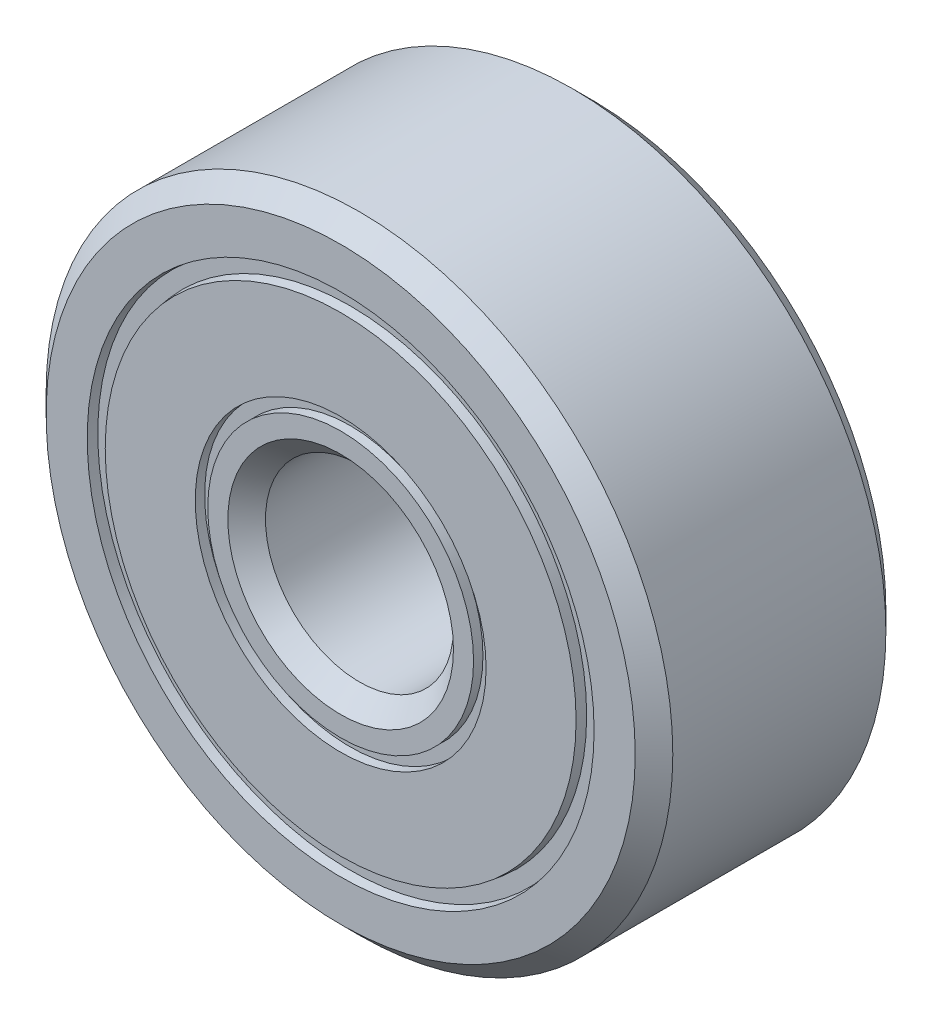
ISO-10303-21;
HEADER;
FILE_DESCRIPTION(('STEP AP214'),'2;1');
FILE_NAME('part.step','',(''),(''),'','','');
FILE_SCHEMA(('AUTOMOTIVE_DESIGN { 1 0 10303 214 1 1 1 1 }'));
ENDSEC;
DATA;
#1=APPLICATION_CONTEXT('core data for automotive mechanical design processes');
#2=APPLICATION_PROTOCOL_DEFINITION('international standard','automotive_design',2000,#1);
#3=PRODUCT_CONTEXT('',#1,'mechanical');
#4=PRODUCT('Part','Part','',(#3));
#5=PRODUCT_RELATED_PRODUCT_CATEGORY('part','',(#4));
#6=PRODUCT_DEFINITION_FORMATION('','',#4);
#7=PRODUCT_DEFINITION_CONTEXT('part definition',#1,'design');
#8=PRODUCT_DEFINITION('design','',#6,#7);
#9=PRODUCT_DEFINITION_SHAPE('','',#8);
#10=(LENGTH_UNIT() NAMED_UNIT(*) SI_UNIT(.MILLI.,.METRE.));
#11=(NAMED_UNIT(*) PLANE_ANGLE_UNIT() SI_UNIT($,.RADIAN.));
#12=(NAMED_UNIT(*) SI_UNIT($,.STERADIAN.) SOLID_ANGLE_UNIT());
#13=UNCERTAINTY_MEASURE_WITH_UNIT(LENGTH_MEASURE(1.E-05),#10,'distance_accuracy_value','');
#14=(GEOMETRIC_REPRESENTATION_CONTEXT(3) GLOBAL_UNCERTAINTY_ASSIGNED_CONTEXT((#13)) GLOBAL_UNIT_ASSIGNED_CONTEXT((#10,
#11,#12)) REPRESENTATION_CONTEXT('',''));
#15=CARTESIAN_POINT('',(0.,0.,0.));
#16=DIRECTION('',(0.,0.,1.));
#17=DIRECTION('',(1.,0.,0.));
#18=AXIS2_PLACEMENT_3D('',#15,#16,#17);
#19=CARTESIAN_POINT('',(0.,0.,4.));
#20=DIRECTION('',(0.,0.,1.));
#21=DIRECTION('',(1.,0.,0.));
#22=AXIS2_PLACEMENT_3D('',#19,#20,#21);
#23=PLANE('',#22);
#24=CARTESIAN_POINT('',(0.,0.,4.));
#25=DIRECTION('',(0.,0.,1.));
#26=DIRECTION('',(1.,0.,0.));
#27=AXIS2_PLACEMENT_3D('',#24,#25,#26);
#28=CIRCLE('',#27,1.8);
#29=CARTESIAN_POINT('',(1.8,0.,4.));
#30=VERTEX_POINT('',#29);
#31=EDGE_CURVE('E49',#30,#30,#28,.F.);
#32=ORIENTED_EDGE('',*,*,#31,.T.);
#33=EDGE_LOOP('',(#32));
#34=FACE_BOUND('',#33,.T.);
#35=CARTESIAN_POINT('',(0.,0.,4.));
#36=DIRECTION('',(0.,0.,1.));
#37=DIRECTION('',(1.,0.,0.));
#38=AXIS2_PLACEMENT_3D('',#35,#36,#37);
#39=CIRCLE('',#38,2.12073359611509);
#40=CARTESIAN_POINT('',(2.12073359611509,0.,4.));
#41=VERTEX_POINT('',#40);
#42=EDGE_CURVE('E40',#41,#41,#39,.T.);
#43=ORIENTED_EDGE('',*,*,#42,.T.);
#44=EDGE_LOOP('',(#43));
#45=FACE_BOUND('',#44,.T.);
#46=ADVANCED_FACE('F36',(#34,#45),#23,.T.);
#47=CARTESIAN_POINT('',(0.,0.,4.));
#48=DIRECTION('',(0.,0.,1.));
#49=DIRECTION('',(1.,0.,0.));
#50=AXIS2_PLACEMENT_3D('',#47,#48,#49);
#51=CIRCLE('',#50,3.75671669190625);
#52=CARTESIAN_POINT('',(3.75671669190625,0.,4.));
#53=VERTEX_POINT('',#52);
#54=EDGE_CURVE('E53',#53,#53,#51,.T.);
#55=ORIENTED_EDGE('',*,*,#54,.T.);
#56=EDGE_LOOP('',(#55));
#57=FACE_BOUND('',#56,.T.);
#58=CARTESIAN_POINT('',(0.,0.,4.));
#59=DIRECTION('',(0.,0.,1.));
#60=DIRECTION('',(1.,0.,0.));
#61=AXIS2_PLACEMENT_3D('',#58,#59,#60);
#62=CIRCLE('',#61,2.32073359611509);
#63=CARTESIAN_POINT('',(2.32073359611509,0.,4.));
#64=VERTEX_POINT('',#63);
#65=EDGE_CURVE('E76',#64,#64,#62,.F.);
#66=ORIENTED_EDGE('',*,*,#65,.T.);
#67=EDGE_LOOP('',(#66));
#68=FACE_BOUND('',#67,.T.);
#69=ADVANCED_FACE('F145',(#57,#68),#23,.T.);
#70=CARTESIAN_POINT('',(0.,0.,0.));
#71=DIRECTION('',(0.,0.,1.));
#72=DIRECTION('',(1.,0.,0.));
#73=AXIS2_PLACEMENT_3D('',#70,#71,#72);
#74=PLANE('',#73);
#75=CARTESIAN_POINT('',(0.,0.,0.));
#76=DIRECTION('',(0.,0.,1.));
#77=DIRECTION('',(1.,0.,0.));
#78=AXIS2_PLACEMENT_3D('',#75,#76,#77);
#79=CIRCLE('',#78,3.75671669190625);
#80=CARTESIAN_POINT('',(3.75671669190625,0.,0.));
#81=VERTEX_POINT('',#80);
#82=EDGE_CURVE('E64',#81,#81,#79,.T.);
#83=ORIENTED_EDGE('',*,*,#82,.F.);
#84=EDGE_LOOP('',(#83));
#85=FACE_BOUND('',#84,.T.);
#86=CARTESIAN_POINT('',(0.,0.,0.));
#87=DIRECTION('',(0.,0.,1.));
#88=DIRECTION('',(1.,0.,0.));
#89=AXIS2_PLACEMENT_3D('',#86,#87,#88);
#90=CIRCLE('',#89,2.32073359611509);
#91=CARTESIAN_POINT('',(2.32073359611509,0.,0.));
#92=VERTEX_POINT('',#91);
#93=EDGE_CURVE('E72',#92,#92,#90,.F.);
#94=ORIENTED_EDGE('',*,*,#93,.F.);
#95=EDGE_LOOP('',(#94));
#96=FACE_BOUND('',#95,.T.);
#97=ADVANCED_FACE('F149',(#85,#96),#74,.F.);
#98=CARTESIAN_POINT('',(0.,0.,0.));
#99=DIRECTION('',(0.,0.,1.));
#100=DIRECTION('',(1.,0.,0.));
#101=AXIS2_PLACEMENT_3D('',#98,#99,#100);
#102=CIRCLE('',#101,1.8);
#103=CARTESIAN_POINT('',(1.8,0.,0.));
#104=VERTEX_POINT('',#103);
#105=EDGE_CURVE('E105',#104,#104,#102,.T.);
#106=ORIENTED_EDGE('',*,*,#105,.T.);
#107=EDGE_LOOP('',(#106));
#108=FACE_BOUND('',#107,.T.);
#109=CARTESIAN_POINT('',(0.,0.,0.));
#110=DIRECTION('',(0.,0.,1.));
#111=DIRECTION('',(1.,0.,0.));
#112=AXIS2_PLACEMENT_3D('',#109,#110,#111);
#113=CIRCLE('',#112,2.12073359611509);
#114=CARTESIAN_POINT('',(2.12073359611509,0.,0.));
#115=VERTEX_POINT('',#114);
#116=EDGE_CURVE('E69',#115,#115,#113,.T.);
#117=ORIENTED_EDGE('',*,*,#116,.F.);
#118=EDGE_LOOP('',(#117));
#119=FACE_BOUND('',#118,.T.);
#120=ADVANCED_FACE('F158',(#108,#119),#74,.F.);
#121=CARTESIAN_POINT('',(0.,0.,0.));
#122=DIRECTION('',(0.,0.,1.));
#123=DIRECTION('',(1.,0.,0.));
#124=AXIS2_PLACEMENT_3D('',#121,#122,#123);
#125=CIRCLE('',#124,4.7);
#126=CARTESIAN_POINT('',(4.7,0.,0.));
#127=VERTEX_POINT('',#126);
#128=EDGE_CURVE('E60',#127,#127,#125,.F.);
#129=ORIENTED_EDGE('',*,*,#128,.T.);
#130=EDGE_LOOP('',(#129));
#131=FACE_BOUND('',#130,.T.);
#132=CARTESIAN_POINT('',(0.,0.,0.));
#133=DIRECTION('',(0.,0.,1.));
#134=DIRECTION('',(1.,0.,0.));
#135=AXIS2_PLACEMENT_3D('',#132,#133,#134);
#136=CIRCLE('',#135,4.04421669190625);
#137=CARTESIAN_POINT('',(4.04421669190625,0.,0.));
#138=VERTEX_POINT('',#137);
#139=EDGE_CURVE('E61',#138,#138,#136,.F.);
#140=ORIENTED_EDGE('',*,*,#139,.F.);
#141=EDGE_LOOP('',(#140));
#142=FACE_BOUND('',#141,.T.);
#143=ADVANCED_FACE('F153',(#131,#142),#74,.F.);
#144=CARTESIAN_POINT('',(0.,0.,4.));
#145=DIRECTION('',(0.,0.,1.));
#146=DIRECTION('',(1.,0.,0.));
#147=AXIS2_PLACEMENT_3D('',#144,#145,#146);
#148=CIRCLE('',#147,4.7);
#149=CARTESIAN_POINT('',(4.7,0.,4.));
#150=VERTEX_POINT('',#149);
#151=EDGE_CURVE('E114',#150,#150,#148,.T.);
#152=ORIENTED_EDGE('',*,*,#151,.T.);
#153=EDGE_LOOP('',(#152));
#154=FACE_BOUND('',#153,.T.);
#155=CARTESIAN_POINT('',(0.,0.,4.));
#156=DIRECTION('',(0.,0.,1.));
#157=DIRECTION('',(1.,0.,0.));
#158=AXIS2_PLACEMENT_3D('',#155,#156,#157);
#159=CIRCLE('',#158,4.04421669190625);
#160=CARTESIAN_POINT('',(4.04421669190625,0.,4.));
#161=VERTEX_POINT('',#160);
#162=EDGE_CURVE('E56',#161,#161,#159,.F.);
#163=ORIENTED_EDGE('',*,*,#162,.T.);
#164=EDGE_LOOP('',(#163));
#165=FACE_BOUND('',#164,.T.);
#166=ADVANCED_FACE('F140',(#154,#165),#23,.T.);
#167=CARTESIAN_POINT('',(0.,0.,4.));
#168=DIRECTION('',(0.,0.,-1.));
#169=DIRECTION('',(-1.,0.,0.));
#170=AXIS2_PLACEMENT_3D('',#167,#168,#169);
#171=CYLINDRICAL_SURFACE('',#170,5.);
#172=CARTESIAN_POINT('',(0.,0.,0.300000000000003));
#173=DIRECTION('',(0.,0.,1.));
#174=DIRECTION('',(1.,0.,0.));
#175=AXIS2_PLACEMENT_3D('',#172,#173,#174);
#176=CIRCLE('',#175,5.);
#177=CARTESIAN_POINT('',(5.,0.,0.300000000000003));
#178=VERTEX_POINT('',#177);
#179=EDGE_CURVE('E10',#178,#178,#176,.T.);
#180=ORIENTED_EDGE('',*,*,#179,.T.);
#181=EDGE_LOOP('',(#180));
#182=FACE_BOUND('',#181,.T.);
#183=CARTESIAN_POINT('',(0.,0.,3.7));
#184=DIRECTION('',(0.,0.,1.));
#185=DIRECTION('',(1.,0.,0.));
#186=AXIS2_PLACEMENT_3D('',#183,#184,#185);
#187=CIRCLE('',#186,5.);
#188=CARTESIAN_POINT('',(5.,0.,3.7));
#189=VERTEX_POINT('',#188);
#190=EDGE_CURVE('E44',#189,#189,#187,.F.);
#191=ORIENTED_EDGE('',*,*,#190,.T.);
#192=EDGE_LOOP('',(#191));
#193=FACE_BOUND('',#192,.T.);
#194=ADVANCED_FACE('F131',(#182,#193),#171,.T.);
#195=CARTESIAN_POINT('',(0.,0.,4.));
#196=DIRECTION('',(0.,0.,-1.));
#197=DIRECTION('',(-1.,0.,0.));
#198=AXIS2_PLACEMENT_3D('',#195,#196,#197);
#199=CYLINDRICAL_SURFACE('',#198,1.5);
#200=CARTESIAN_POINT('',(0.,0.,0.300000000000002));
#201=DIRECTION('',(0.,0.,1.));
#202=DIRECTION('',(1.,0.,0.));
#203=AXIS2_PLACEMENT_3D('',#200,#201,#202);
#204=CIRCLE('',#203,1.5);
#205=CARTESIAN_POINT('',(1.5,0.,0.300000000000002));
#206=VERTEX_POINT('',#205);
#207=EDGE_CURVE('E111',#206,#206,#204,.F.);
#208=ORIENTED_EDGE('',*,*,#207,.T.);
#209=EDGE_LOOP('',(#208));
#210=FACE_BOUND('',#209,.T.);
#211=CARTESIAN_POINT('',(0.,0.,3.7));
#212=DIRECTION('',(0.,0.,1.));
#213=DIRECTION('',(1.,0.,0.));
#214=AXIS2_PLACEMENT_3D('',#211,#212,#213);
#215=CIRCLE('',#214,1.5);
#216=CARTESIAN_POINT('',(1.5,0.,3.7));
#217=VERTEX_POINT('',#216);
#218=EDGE_CURVE('E108',#217,#217,#215,.T.);
#219=ORIENTED_EDGE('',*,*,#218,.T.);
#220=EDGE_LOOP('',(#219));
#221=FACE_BOUND('',#220,.T.);
#222=ADVANCED_FACE('F129',(#210,#221),#199,.F.);
#223=CARTESIAN_POINT('',(0.,0.,0.));
#224=DIRECTION('',(0.,0.,-1.));
#225=DIRECTION('',(-1.,0.,0.));
#226=AXIS2_PLACEMENT_3D('',#223,#224,#225);
#227=CONICAL_SURFACE('',#226,1.8,0.785398163397447);
#228=ORIENTED_EDGE('',*,*,#207,.F.);
#229=EDGE_LOOP('',(#228));
#230=FACE_BOUND('',#229,.T.);
#231=ORIENTED_EDGE('',*,*,#105,.F.);
#232=EDGE_LOOP('',(#231));
#233=FACE_BOUND('',#232,.T.);
#234=ADVANCED_FACE('F125',(#230,#233),#227,.F.);
#235=CARTESIAN_POINT('',(0.,0.,3.7));
#236=DIRECTION('',(0.,0.,1.));
#237=DIRECTION('',(1.,0.,0.));
#238=AXIS2_PLACEMENT_3D('',#235,#236,#237);
#239=CONICAL_SURFACE('',#238,1.5,0.785398163397451);
#240=ORIENTED_EDGE('',*,*,#31,.F.);
#241=EDGE_LOOP('',(#240));
#242=FACE_BOUND('',#241,.T.);
#243=ORIENTED_EDGE('',*,*,#218,.F.);
#244=EDGE_LOOP('',(#243));
#245=FACE_BOUND('',#244,.T.);
#246=ADVANCED_FACE('F121',(#242,#245),#239,.F.);
#247=CARTESIAN_POINT('',(0.,0.,0.300000000000003));
#248=DIRECTION('',(0.,0.,1.));
#249=DIRECTION('',(1.,0.,0.));
#250=AXIS2_PLACEMENT_3D('',#247,#248,#249);
#251=CONICAL_SURFACE('',#250,5.,0.78539816339745);
#252=ORIENTED_EDGE('',*,*,#128,.F.);
#253=EDGE_LOOP('',(#252));
#254=FACE_BOUND('',#253,.T.);
#255=ORIENTED_EDGE('',*,*,#179,.F.);
#256=EDGE_LOOP('',(#255));
#257=FACE_BOUND('',#256,.T.);
#258=ADVANCED_FACE('F124',(#254,#257),#251,.T.);
#259=CARTESIAN_POINT('',(0.,0.,4.));
#260=DIRECTION('',(0.,0.,-1.));
#261=DIRECTION('',(-1.,0.,0.));
#262=AXIS2_PLACEMENT_3D('',#259,#260,#261);
#263=CONICAL_SURFACE('',#262,4.7,0.785398163397445);
#264=ORIENTED_EDGE('',*,*,#190,.F.);
#265=EDGE_LOOP('',(#264));
#266=FACE_BOUND('',#265,.T.);
#267=ORIENTED_EDGE('',*,*,#151,.F.);
#268=EDGE_LOOP('',(#267));
#269=FACE_BOUND('',#268,.T.);
#270=ADVANCED_FACE('F38',(#266,#269),#263,.T.);
#271=CARTESIAN_POINT('',(0.,0.,3.85));
#272=DIRECTION('',(0.,0.,1.));
#273=DIRECTION('',(1.,0.,0.));
#274=AXIS2_PLACEMENT_3D('',#271,#272,#273);
#275=CONICAL_SURFACE('',#274,4.02546669190624,0.124354994546761);
#276=ORIENTED_EDGE('',*,*,#162,.F.);
#277=EDGE_LOOP('',(#276));
#278=FACE_BOUND('',#277,.T.);
#279=CARTESIAN_POINT('',(0.,0.,3.85));
#280=DIRECTION('',(0.,0.,1.));
#281=DIRECTION('',(1.,0.,0.));
#282=AXIS2_PLACEMENT_3D('',#279,#280,#281);
#283=CIRCLE('',#282,4.02546669190624);
#284=CARTESIAN_POINT('',(4.02546669190624,0.,3.85));
#285=VERTEX_POINT('',#284);
#286=EDGE_CURVE('E57',#285,#285,#283,.T.);
#287=ORIENTED_EDGE('',*,*,#286,.F.);
#288=EDGE_LOOP('',(#287));
#289=FACE_BOUND('',#288,.T.);
#290=ADVANCED_FACE('F164',(#278,#289),#275,.F.);
#291=CARTESIAN_POINT('',(0.,4.02546669190624,3.85));
#292=DIRECTION('',(0.,0.,1.));
#293=DIRECTION('',(1.,0.,0.));
#294=AXIS2_PLACEMENT_3D('',#291,#292,#293);
#295=PLANE('',#294);
#296=ORIENTED_EDGE('',*,*,#286,.T.);
#297=EDGE_LOOP('',(#296));
#298=FACE_BOUND('',#297,.T.);
#299=CARTESIAN_POINT('',(0.,0.,3.85));
#300=DIRECTION('',(0.,0.,1.));
#301=DIRECTION('',(1.,0.,0.));
#302=AXIS2_PLACEMENT_3D('',#299,#300,#301);
#303=CIRCLE('',#302,3.77546669190624);
#304=CARTESIAN_POINT('',(3.77546669190624,0.,3.85));
#305=VERTEX_POINT('',#304);
#306=EDGE_CURVE('E68',#305,#305,#303,.T.);
#307=ORIENTED_EDGE('',*,*,#306,.F.);
#308=EDGE_LOOP('',(#307));
#309=FACE_BOUND('',#308,.T.);
#310=ADVANCED_FACE('F167',(#298,#309),#295,.T.);
#311=CARTESIAN_POINT('',(0.,0.,4.85));
#312=DIRECTION('',(0.,0.,-1.));
#313=DIRECTION('',(-1.,0.,0.));
#314=AXIS2_PLACEMENT_3D('',#311,#312,#313);
#315=CONICAL_SURFACE('',#314,3.65046669190624,0.124354994546761);
#316=ORIENTED_EDGE('',*,*,#54,.F.);
#317=EDGE_LOOP('',(#316));
#318=FACE_BOUND('',#317,.T.);
#319=ORIENTED_EDGE('',*,*,#306,.T.);
#320=EDGE_LOOP('',(#319));
#321=FACE_BOUND('',#320,.T.);
#322=ADVANCED_FACE('F172',(#318,#321),#315,.T.);
#323=CARTESIAN_POINT('',(0.,0.,0.150000000000004));
#324=DIRECTION('',(0.,0.,1.));
#325=DIRECTION('',(1.,0.,0.));
#326=AXIS2_PLACEMENT_3D('',#323,#324,#325);
#327=CONICAL_SURFACE('',#326,3.77546669190625,0.124354994546762);
#328=CARTESIAN_POINT('',(0.,0.,0.150000000000004));
#329=DIRECTION('',(0.,0.,1.));
#330=DIRECTION('',(1.,0.,0.));
#331=AXIS2_PLACEMENT_3D('',#328,#329,#330);
#332=CIRCLE('',#331,3.77546669190625);
#333=CARTESIAN_POINT('',(3.77546669190625,0.,0.150000000000004));
#334=VERTEX_POINT('',#333);
#335=EDGE_CURVE('E75',#334,#334,#332,.T.);
#336=ORIENTED_EDGE('',*,*,#335,.F.);
#337=EDGE_LOOP('',(#336));
#338=FACE_BOUND('',#337,.T.);
#339=ORIENTED_EDGE('',*,*,#82,.T.);
#340=EDGE_LOOP('',(#339));
#341=FACE_BOUND('',#340,.T.);
#342=ADVANCED_FACE('F177',(#338,#341),#327,.T.);
#343=CARTESIAN_POINT('',(0.,0.,-0.849999999999995));
#344=DIRECTION('',(0.,0.,-1.));
#345=DIRECTION('',(-1.,0.,0.));
#346=AXIS2_PLACEMENT_3D('',#343,#344,#345);
#347=CONICAL_SURFACE('',#346,4.15046669190624,0.124354994546762);
#348=CARTESIAN_POINT('',(0.,0.,0.150000000000004));
#349=DIRECTION('',(0.,0.,1.));
#350=DIRECTION('',(1.,0.,0.));
#351=AXIS2_PLACEMENT_3D('',#348,#349,#350);
#352=CIRCLE('',#351,4.02546669190624);
#353=CARTESIAN_POINT('',(4.02546669190624,0.,0.150000000000004));
#354=VERTEX_POINT('',#353);
#355=EDGE_CURVE('E65',#354,#354,#352,.T.);
#356=ORIENTED_EDGE('',*,*,#355,.T.);
#357=EDGE_LOOP('',(#356));
#358=FACE_BOUND('',#357,.T.);
#359=ORIENTED_EDGE('',*,*,#139,.T.);
#360=EDGE_LOOP('',(#359));
#361=FACE_BOUND('',#360,.T.);
#362=ADVANCED_FACE('F183',(#358,#361),#347,.F.);
#363=CARTESIAN_POINT('',(0.,4.02546669190624,0.150000000000005));
#364=DIRECTION('',(0.,0.,-1.));
#365=DIRECTION('',(-1.,0.,0.));
#366=AXIS2_PLACEMENT_3D('',#363,#364,#365);
#367=PLANE('',#366);
#368=ORIENTED_EDGE('',*,*,#335,.T.);
#369=EDGE_LOOP('',(#368));
#370=FACE_BOUND('',#369,.T.);
#371=ORIENTED_EDGE('',*,*,#355,.F.);
#372=EDGE_LOOP('',(#371));
#373=FACE_BOUND('',#372,.T.);
#374=ADVANCED_FACE('F190',(#370,#373),#367,.T.);
#375=CARTESIAN_POINT('',(0.,0.,12.4113492427966));
#376=DIRECTION('',(0.,0.,1.));
#377=DIRECTION('',(1.,0.,0.));
#378=AXIS2_PLACEMENT_3D('',#375,#376,#377);
#379=CYLINDRICAL_SURFACE('',#378,2.32073359611509);
#380=CARTESIAN_POINT('',(0.,0.,0.150000000000003));
#381=DIRECTION('',(0.,0.,1.));
#382=DIRECTION('',(1.,0.,0.));
#383=AXIS2_PLACEMENT_3D('',#380,#381,#382);
#384=CIRCLE('',#383,2.32073359611509);
#385=CARTESIAN_POINT('',(2.32073359611509,0.,0.150000000000003));
#386=VERTEX_POINT('',#385);
#387=EDGE_CURVE('E73',#386,#386,#384,.T.);
#388=ORIENTED_EDGE('',*,*,#387,.T.);
#389=EDGE_LOOP('',(#388));
#390=FACE_BOUND('',#389,.T.);
#391=ORIENTED_EDGE('',*,*,#93,.T.);
#392=EDGE_LOOP('',(#391));
#393=FACE_BOUND('',#392,.T.);
#394=ADVANCED_FACE('F194',(#390,#393),#379,.F.);
#395=CARTESIAN_POINT('',(0.,0.,12.4113492427966));
#396=DIRECTION('',(0.,0.,1.));
#397=DIRECTION('',(1.,0.,0.));
#398=AXIS2_PLACEMENT_3D('',#395,#396,#397);
#399=CYLINDRICAL_SURFACE('',#398,2.12073359611509);
#400=CARTESIAN_POINT('',(0.,0.,0.150000000000003));
#401=DIRECTION('',(0.,0.,1.));
#402=DIRECTION('',(1.,0.,0.));
#403=AXIS2_PLACEMENT_3D('',#400,#401,#402);
#404=CIRCLE('',#403,2.12073359611509);
#405=CARTESIAN_POINT('',(2.12073359611509,0.,0.150000000000003));
#406=VERTEX_POINT('',#405);
#407=EDGE_CURVE('E82',#406,#406,#404,.T.);
#408=ORIENTED_EDGE('',*,*,#407,.F.);
#409=EDGE_LOOP('',(#408));
#410=FACE_BOUND('',#409,.T.);
#411=ORIENTED_EDGE('',*,*,#116,.T.);
#412=EDGE_LOOP('',(#411));
#413=FACE_BOUND('',#412,.T.);
#414=ADVANCED_FACE('F198',(#410,#413),#399,.T.);
#415=CARTESIAN_POINT('',(0.,2.32073359611509,0.150000000000003));
#416=DIRECTION('',(0.,0.,-1.));
#417=DIRECTION('',(-1.,0.,0.));
#418=AXIS2_PLACEMENT_3D('',#415,#416,#417);
#419=PLANE('',#418);
#420=ORIENTED_EDGE('',*,*,#407,.T.);
#421=EDGE_LOOP('',(#420));
#422=FACE_BOUND('',#421,.T.);
#423=ORIENTED_EDGE('',*,*,#387,.F.);
#424=EDGE_LOOP('',(#423));
#425=FACE_BOUND('',#424,.T.);
#426=ADVANCED_FACE('F200',(#422,#425),#419,.T.);
#427=CARTESIAN_POINT('',(0.,0.,12.4113492427966));
#428=DIRECTION('',(0.,0.,1.));
#429=DIRECTION('',(1.,0.,0.));
#430=AXIS2_PLACEMENT_3D('',#427,#428,#429);
#431=CYLINDRICAL_SURFACE('',#430,2.12073359611509);
#432=ORIENTED_EDGE('',*,*,#42,.F.);
#433=EDGE_LOOP('',(#432));
#434=FACE_BOUND('',#433,.T.);
#435=CARTESIAN_POINT('',(0.,0.,3.85));
#436=DIRECTION('',(0.,0.,1.));
#437=DIRECTION('',(1.,0.,0.));
#438=AXIS2_PLACEMENT_3D('',#435,#436,#437);
#439=CIRCLE('',#438,2.12073359611509);
#440=CARTESIAN_POINT('',(2.12073359611509,0.,3.85));
#441=VERTEX_POINT('',#440);
#442=EDGE_CURVE('E78',#441,#441,#439,.T.);
#443=ORIENTED_EDGE('',*,*,#442,.T.);
#444=EDGE_LOOP('',(#443));
#445=FACE_BOUND('',#444,.T.);
#446=ADVANCED_FACE('F203',(#434,#445),#431,.T.);
#447=CARTESIAN_POINT('',(0.,2.32073359611509,3.85));
#448=DIRECTION('',(0.,0.,1.));
#449=DIRECTION('',(1.,0.,0.));
#450=AXIS2_PLACEMENT_3D('',#447,#448,#449);
#451=PLANE('',#450);
#452=CARTESIAN_POINT('',(0.,0.,3.85));
#453=DIRECTION('',(0.,0.,1.));
#454=DIRECTION('',(1.,0.,0.));
#455=AXIS2_PLACEMENT_3D('',#452,#453,#454);
#456=CIRCLE('',#455,2.32073359611509);
#457=CARTESIAN_POINT('',(2.32073359611509,0.,3.85));
#458=VERTEX_POINT('',#457);
#459=EDGE_CURVE('E84',#458,#458,#456,.T.);
#460=ORIENTED_EDGE('',*,*,#459,.T.);
#461=EDGE_LOOP('',(#460));
#462=FACE_BOUND('',#461,.T.);
#463=ORIENTED_EDGE('',*,*,#442,.F.);
#464=EDGE_LOOP('',(#463));
#465=FACE_BOUND('',#464,.T.);
#466=ADVANCED_FACE('F210',(#462,#465),#451,.T.);
#467=CARTESIAN_POINT('',(0.,0.,12.4113492427966));
#468=DIRECTION('',(0.,0.,1.));
#469=DIRECTION('',(1.,0.,0.));
#470=AXIS2_PLACEMENT_3D('',#467,#468,#469);
#471=CYLINDRICAL_SURFACE('',#470,2.32073359611509);
#472=ORIENTED_EDGE('',*,*,#65,.F.);
#473=EDGE_LOOP('',(#472));
#474=FACE_BOUND('',#473,.T.);
#475=ORIENTED_EDGE('',*,*,#459,.F.);
#476=EDGE_LOOP('',(#475));
#477=FACE_BOUND('',#476,.T.);
#478=ADVANCED_FACE('F214',(#474,#477),#471,.F.);
#479=CLOSED_SHELL('',(#46,#69,#97,#120,#143,#166,#194,#222,#234,#246,#258,#270,#290,#310,#322,
#342,#362,#374,#394,#414,#426,#446,#466,#478));
#480=MANIFOLD_SOLID_BREP('B2',#479);
#481=ADVANCED_BREP_SHAPE_REPRESENTATION('',(#18,#480),#14);
#482=SHAPE_DEFINITION_REPRESENTATION(#9,#481);
ENDSEC;
END-ISO-10303-21;
